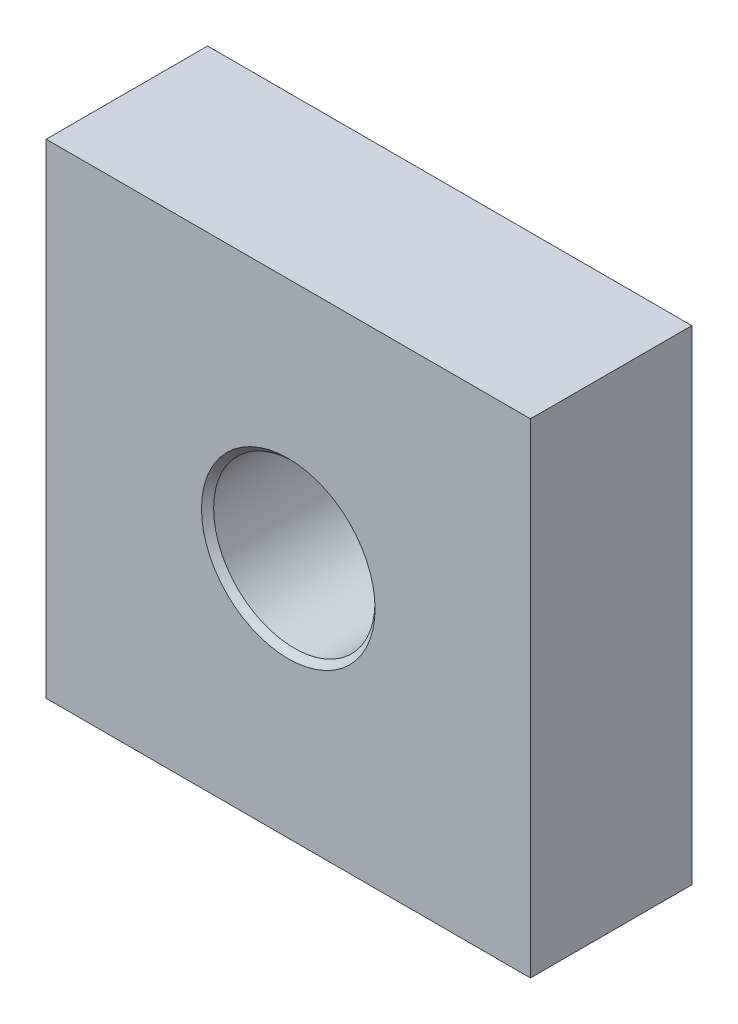
ISO-10303-21;
HEADER;
FILE_DESCRIPTION(('STEP AP214'),'2;1');
FILE_NAME('part.step','',(''),(''),'','','');
FILE_SCHEMA(('AUTOMOTIVE_DESIGN { 1 0 10303 214 1 1 1 1 }'));
ENDSEC;
DATA;
#1=APPLICATION_CONTEXT('core data for automotive mechanical design processes');
#2=APPLICATION_PROTOCOL_DEFINITION('international standard','automotive_design',2000,#1);
#3=PRODUCT_CONTEXT('',#1,'mechanical');
#4=PRODUCT('Part','Part','',(#3));
#5=PRODUCT_RELATED_PRODUCT_CATEGORY('part','',(#4));
#6=PRODUCT_DEFINITION_FORMATION('','',#4);
#7=PRODUCT_DEFINITION_CONTEXT('part definition',#1,'design');
#8=PRODUCT_DEFINITION('design','',#6,#7);
#9=PRODUCT_DEFINITION_SHAPE('','',#8);
#10=(LENGTH_UNIT() NAMED_UNIT(*) SI_UNIT(.MILLI.,.METRE.));
#11=(NAMED_UNIT(*) PLANE_ANGLE_UNIT() SI_UNIT($,.RADIAN.));
#12=(NAMED_UNIT(*) SI_UNIT($,.STERADIAN.) SOLID_ANGLE_UNIT());
#13=UNCERTAINTY_MEASURE_WITH_UNIT(LENGTH_MEASURE(1.E-05),#10,'distance_accuracy_value','');
#14=(GEOMETRIC_REPRESENTATION_CONTEXT(3) GLOBAL_UNCERTAINTY_ASSIGNED_CONTEXT((#13)) GLOBAL_UNIT_ASSIGNED_CONTEXT((#10,
#11,#12)) REPRESENTATION_CONTEXT('',''));
#15=CARTESIAN_POINT('',(0.,0.,0.));
#16=DIRECTION('',(0.,0.,1.));
#17=DIRECTION('',(1.,0.,0.));
#18=AXIS2_PLACEMENT_3D('',#15,#16,#17);
#19=CARTESIAN_POINT('',(-60.,-60.,20.));
#20=DIRECTION('',(0.,0.,1.));
#21=DIRECTION('',(1.,0.,0.));
#22=AXIS2_PLACEMENT_3D('',#19,#20,#21);
#23=PLANE('',#22);
#24=CARTESIAN_POINT('',(0.,0.,20.));
#25=DIRECTION('',(0.,0.,1.));
#26=DIRECTION('',(1.,0.,0.));
#27=AXIS2_PLACEMENT_3D('',#24,#25,#26);
#28=CIRCLE('',#27,21.5);
#29=CARTESIAN_POINT('',(21.5,0.,20.));
#30=VERTEX_POINT('',#29);
#31=EDGE_CURVE('E11',#30,#30,#28,.F.);
#32=ORIENTED_EDGE('',*,*,#31,.T.);
#33=EDGE_LOOP('',(#32));
#34=FACE_BOUND('',#33,.T.);
#35=DIRECTION('',(0.,-1.,0.));
#36=VECTOR('',#35,1.);
#37=CARTESIAN_POINT('',(-60.,60.,20.));
#38=LINE('',#37,#36);
#39=CARTESIAN_POINT('',(-60.,60.,20.));
#40=VERTEX_POINT('',#39);
#41=CARTESIAN_POINT('',(-60.,-60.,20.));
#42=VERTEX_POINT('',#41);
#43=EDGE_CURVE('E101',#40,#42,#38,.T.);
#44=ORIENTED_EDGE('',*,*,#43,.T.);
#45=DIRECTION('',(1.,0.,0.));
#46=VECTOR('',#45,1.);
#47=CARTESIAN_POINT('',(-60.,-60.,20.));
#48=LINE('',#47,#46);
#49=CARTESIAN_POINT('',(60.,-60.,20.));
#50=VERTEX_POINT('',#49);
#51=EDGE_CURVE('E87',#42,#50,#48,.T.);
#52=ORIENTED_EDGE('',*,*,#51,.T.);
#53=DIRECTION('',(0.,1.,0.));
#54=VECTOR('',#53,1.);
#55=CARTESIAN_POINT('',(60.,60.,20.));
#56=LINE('',#55,#54);
#57=CARTESIAN_POINT('',(60.,60.,20.));
#58=VERTEX_POINT('',#57);
#59=EDGE_CURVE('E52',#50,#58,#56,.T.);
#60=ORIENTED_EDGE('',*,*,#59,.T.);
#61=DIRECTION('',(-1.,0.,0.));
#62=VECTOR('',#61,1.);
#63=CARTESIAN_POINT('',(-60.,60.,20.));
#64=LINE('',#63,#62);
#65=EDGE_CURVE('E47',#58,#40,#64,.T.);
#66=ORIENTED_EDGE('',*,*,#65,.T.);
#67=EDGE_LOOP('',(#44,#52,#60,#66));
#68=FACE_BOUND('',#67,.T.);
#69=ADVANCED_FACE('F32',(#34,#68),#23,.T.);
#70=CARTESIAN_POINT('',(-60.,-60.,-20.));
#71=DIRECTION('',(0.,0.,1.));
#72=DIRECTION('',(1.,0.,0.));
#73=AXIS2_PLACEMENT_3D('',#70,#71,#72);
#74=PLANE('',#73);
#75=CARTESIAN_POINT('',(0.,0.,-20.));
#76=DIRECTION('',(0.,0.,1.));
#77=DIRECTION('',(1.,0.,0.));
#78=AXIS2_PLACEMENT_3D('',#75,#76,#77);
#79=CIRCLE('',#78,21.5);
#80=CARTESIAN_POINT('',(21.5,0.,-20.));
#81=VERTEX_POINT('',#80);
#82=EDGE_CURVE('E90',#81,#81,#79,.T.);
#83=ORIENTED_EDGE('',*,*,#82,.T.);
#84=EDGE_LOOP('',(#83));
#85=FACE_BOUND('',#84,.T.);
#86=DIRECTION('',(0.,-1.,0.));
#87=VECTOR('',#86,1.);
#88=CARTESIAN_POINT('',(-60.,60.,-20.));
#89=LINE('',#88,#87);
#90=CARTESIAN_POINT('',(-60.,60.,-20.));
#91=VERTEX_POINT('',#90);
#92=CARTESIAN_POINT('',(-60.,-60.,-20.));
#93=VERTEX_POINT('',#92);
#94=EDGE_CURVE('E78',#91,#93,#89,.T.);
#95=ORIENTED_EDGE('',*,*,#94,.F.);
#96=DIRECTION('',(-1.,0.,0.));
#97=VECTOR('',#96,1.);
#98=CARTESIAN_POINT('',(-60.,60.,-20.));
#99=LINE('',#98,#97);
#100=CARTESIAN_POINT('',(60.,60.,-20.));
#101=VERTEX_POINT('',#100);
#102=EDGE_CURVE('E99',#101,#91,#99,.T.);
#103=ORIENTED_EDGE('',*,*,#102,.F.);
#104=DIRECTION('',(0.,1.,0.));
#105=VECTOR('',#104,1.);
#106=CARTESIAN_POINT('',(60.,60.,-20.));
#107=LINE('',#106,#105);
#108=CARTESIAN_POINT('',(60.,-60.,-20.));
#109=VERTEX_POINT('',#108);
#110=EDGE_CURVE('E79',#109,#101,#107,.T.);
#111=ORIENTED_EDGE('',*,*,#110,.F.);
#112=DIRECTION('',(1.,0.,0.));
#113=VECTOR('',#112,1.);
#114=CARTESIAN_POINT('',(-60.,-60.,-20.));
#115=LINE('',#114,#113);
#116=EDGE_CURVE('E73',#93,#109,#115,.T.);
#117=ORIENTED_EDGE('',*,*,#116,.F.);
#118=EDGE_LOOP('',(#95,#103,#111,#117));
#119=FACE_BOUND('',#118,.T.);
#120=ADVANCED_FACE('F75',(#85,#119),#74,.F.);
#121=CARTESIAN_POINT('',(-60.,60.,20.));
#122=DIRECTION('',(1.,0.,0.));
#123=DIRECTION('',(0.,1.,0.));
#124=AXIS2_PLACEMENT_3D('',#121,#122,#123);
#125=PLANE('',#124);
#126=ORIENTED_EDGE('',*,*,#94,.T.);
#127=DIRECTION('',(0.,0.,-1.));
#128=VECTOR('',#127,1.);
#129=CARTESIAN_POINT('',(-60.,-60.,20.));
#130=LINE('',#129,#128);
#131=EDGE_CURVE('E85',#42,#93,#130,.T.);
#132=ORIENTED_EDGE('',*,*,#131,.F.);
#133=ORIENTED_EDGE('',*,*,#43,.F.);
#134=DIRECTION('',(0.,0.,-1.));
#135=VECTOR('',#134,1.);
#136=CARTESIAN_POINT('',(-60.,60.,20.));
#137=LINE('',#136,#135);
#138=EDGE_CURVE('E95',#40,#91,#137,.T.);
#139=ORIENTED_EDGE('',*,*,#138,.T.);
#140=EDGE_LOOP('',(#126,#132,#133,#139));
#141=FACE_BOUND('',#140,.T.);
#142=ADVANCED_FACE('F94',(#141),#125,.F.);
#143=CARTESIAN_POINT('',(-60.,-60.,20.));
#144=DIRECTION('',(0.,1.,0.));
#145=DIRECTION('',(-1.,0.,0.));
#146=AXIS2_PLACEMENT_3D('',#143,#144,#145);
#147=PLANE('',#146);
#148=ORIENTED_EDGE('',*,*,#116,.T.);
#149=DIRECTION('',(0.,0.,-1.));
#150=VECTOR('',#149,1.);
#151=CARTESIAN_POINT('',(60.,-60.,20.));
#152=LINE('',#151,#150);
#153=EDGE_CURVE('E91',#50,#109,#152,.T.);
#154=ORIENTED_EDGE('',*,*,#153,.F.);
#155=ORIENTED_EDGE('',*,*,#51,.F.);
#156=ORIENTED_EDGE('',*,*,#131,.T.);
#157=EDGE_LOOP('',(#148,#154,#155,#156));
#158=FACE_BOUND('',#157,.T.);
#159=ADVANCED_FACE('F86',(#158),#147,.F.);
#160=CARTESIAN_POINT('',(60.,60.,20.));
#161=DIRECTION('',(-1.,0.,0.));
#162=DIRECTION('',(0.,-1.,0.));
#163=AXIS2_PLACEMENT_3D('',#160,#161,#162);
#164=PLANE('',#163);
#165=ORIENTED_EDGE('',*,*,#110,.T.);
#166=DIRECTION('',(0.,0.,-1.));
#167=VECTOR('',#166,1.);
#168=CARTESIAN_POINT('',(60.,60.,20.));
#169=LINE('',#168,#167);
#170=EDGE_CURVE('E107',#58,#101,#169,.T.);
#171=ORIENTED_EDGE('',*,*,#170,.F.);
#172=ORIENTED_EDGE('',*,*,#59,.F.);
#173=ORIENTED_EDGE('',*,*,#153,.T.);
#174=EDGE_LOOP('',(#165,#171,#172,#173));
#175=FACE_BOUND('',#174,.T.);
#176=ADVANCED_FACE('F140',(#175),#164,.F.);
#177=CARTESIAN_POINT('',(-60.,60.,20.));
#178=DIRECTION('',(0.,-1.,0.));
#179=DIRECTION('',(1.,0.,0.));
#180=AXIS2_PLACEMENT_3D('',#177,#178,#179);
#181=PLANE('',#180);
#182=ORIENTED_EDGE('',*,*,#102,.T.);
#183=ORIENTED_EDGE('',*,*,#138,.F.);
#184=ORIENTED_EDGE('',*,*,#65,.F.);
#185=ORIENTED_EDGE('',*,*,#170,.T.);
#186=EDGE_LOOP('',(#182,#183,#184,#185));
#187=FACE_BOUND('',#186,.T.);
#188=ADVANCED_FACE('F137',(#187),#181,.F.);
#189=CARTESIAN_POINT('',(0.,0.,20.));
#190=DIRECTION('',(0.,0.,-1.));
#191=DIRECTION('',(-1.,0.,0.));
#192=AXIS2_PLACEMENT_3D('',#189,#190,#191);
#193=CYLINDRICAL_SURFACE('',#192,20.);
#194=CARTESIAN_POINT('',(0.,0.,-18.5));
#195=DIRECTION('',(0.,0.,1.));
#196=DIRECTION('',(1.,0.,0.));
#197=AXIS2_PLACEMENT_3D('',#194,#195,#196);
#198=CIRCLE('',#197,20.);
#199=CARTESIAN_POINT('',(20.,0.,-18.5));
#200=VERTEX_POINT('',#199);
#201=EDGE_CURVE('E40',#200,#200,#198,.F.);
#202=ORIENTED_EDGE('',*,*,#201,.T.);
#203=EDGE_LOOP('',(#202));
#204=FACE_BOUND('',#203,.T.);
#205=CARTESIAN_POINT('',(0.,0.,18.5));
#206=DIRECTION('',(0.,0.,1.));
#207=DIRECTION('',(1.,0.,0.));
#208=AXIS2_PLACEMENT_3D('',#205,#206,#207);
#209=CIRCLE('',#208,20.);
#210=CARTESIAN_POINT('',(20.,0.,18.5));
#211=VERTEX_POINT('',#210);
#212=EDGE_CURVE('E113',#211,#211,#209,.T.);
#213=ORIENTED_EDGE('',*,*,#212,.T.);
#214=EDGE_LOOP('',(#213));
#215=FACE_BOUND('',#214,.T.);
#216=ADVANCED_FACE('F118',(#204,#215),#193,.F.);
#217=CARTESIAN_POINT('',(0.,0.,-20.));
#218=DIRECTION('',(0.,0.,-1.));
#219=DIRECTION('',(-1.,0.,0.));
#220=AXIS2_PLACEMENT_3D('',#217,#218,#219);
#221=CONICAL_SURFACE('',#220,21.5,0.785398163397447);
#222=ORIENTED_EDGE('',*,*,#201,.F.);
#223=EDGE_LOOP('',(#222));
#224=FACE_BOUND('',#223,.T.);
#225=ORIENTED_EDGE('',*,*,#82,.F.);
#226=EDGE_LOOP('',(#225));
#227=FACE_BOUND('',#226,.T.);
#228=ADVANCED_FACE('F121',(#224,#227),#221,.F.);
#229=CARTESIAN_POINT('',(0.,0.,18.5));
#230=DIRECTION('',(0.,0.,1.));
#231=DIRECTION('',(1.,0.,0.));
#232=AXIS2_PLACEMENT_3D('',#229,#230,#231);
#233=CONICAL_SURFACE('',#232,20.,0.785398163397448);
#234=ORIENTED_EDGE('',*,*,#31,.F.);
#235=EDGE_LOOP('',(#234));
#236=FACE_BOUND('',#235,.T.);
#237=ORIENTED_EDGE('',*,*,#212,.F.);
#238=EDGE_LOOP('',(#237));
#239=FACE_BOUND('',#238,.T.);
#240=ADVANCED_FACE('F34',(#236,#239),#233,.F.);
#241=CLOSED_SHELL('',(#69,#120,#142,#159,#176,#188,#216,#228,#240));
#242=MANIFOLD_SOLID_BREP('B2',#241);
#243=ADVANCED_BREP_SHAPE_REPRESENTATION('',(#18,#242),#14);
#244=SHAPE_DEFINITION_REPRESENTATION(#9,#243);
ENDSEC;
END-ISO-10303-21;
